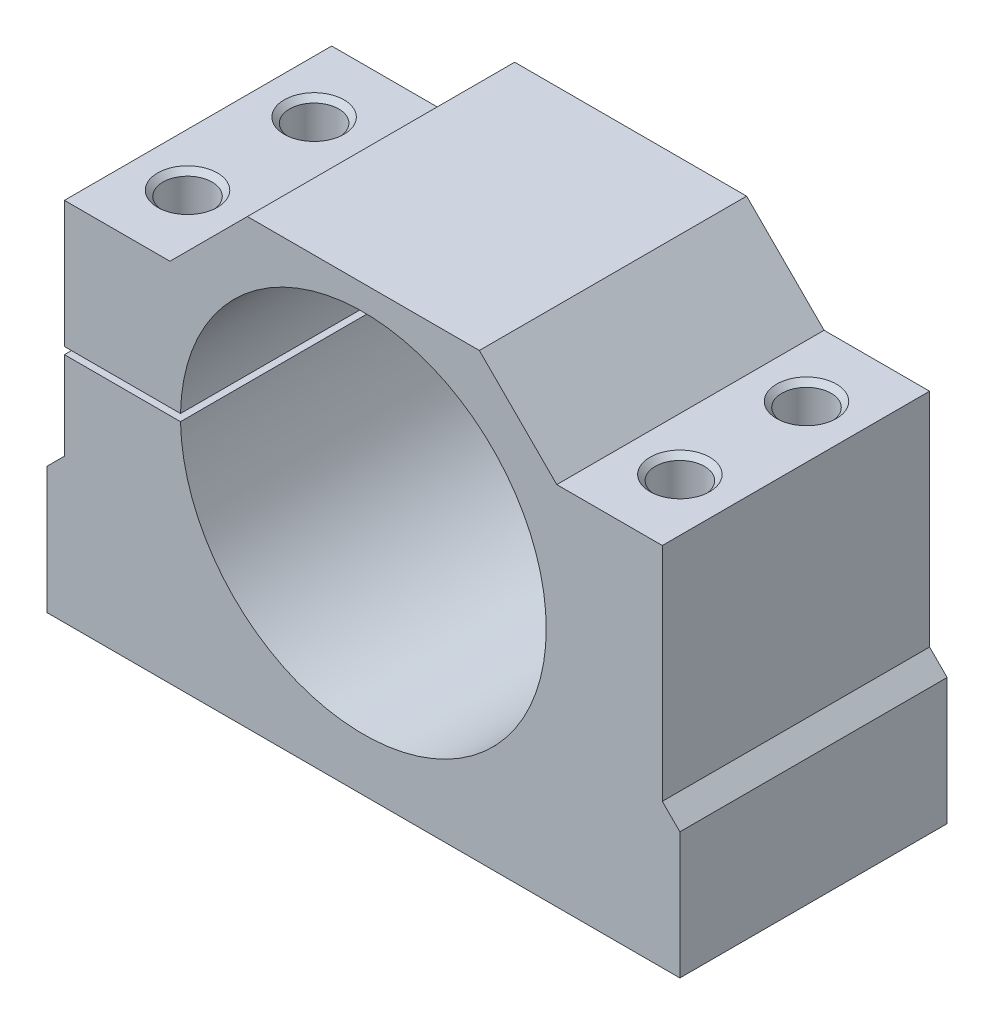
ISO-10303-21;
HEADER;
FILE_DESCRIPTION(('STEP AP214'),'2;1');
FILE_NAME('part.step','',(''),(''),'','','');
FILE_SCHEMA(('AUTOMOTIVE_DESIGN { 1 0 10303 214 1 1 1 1 }'));
ENDSEC;
DATA;
#1=APPLICATION_CONTEXT('core data for automotive mechanical design processes');
#2=APPLICATION_PROTOCOL_DEFINITION('international standard','automotive_design',2000,#1);
#3=PRODUCT_CONTEXT('',#1,'mechanical');
#4=PRODUCT('Part','Part','',(#3));
#5=PRODUCT_RELATED_PRODUCT_CATEGORY('part','',(#4));
#6=PRODUCT_DEFINITION_FORMATION('','',#4);
#7=PRODUCT_DEFINITION_CONTEXT('part definition',#1,'design');
#8=PRODUCT_DEFINITION('design','',#6,#7);
#9=PRODUCT_DEFINITION_SHAPE('','',#8);
#10=(LENGTH_UNIT() NAMED_UNIT(*) SI_UNIT(.MILLI.,.METRE.));
#11=(NAMED_UNIT(*) PLANE_ANGLE_UNIT() SI_UNIT($,.RADIAN.));
#12=(NAMED_UNIT(*) SI_UNIT($,.STERADIAN.) SOLID_ANGLE_UNIT());
#13=UNCERTAINTY_MEASURE_WITH_UNIT(LENGTH_MEASURE(1.E-05),#10,'distance_accuracy_value','');
#14=(GEOMETRIC_REPRESENTATION_CONTEXT(3) GLOBAL_UNCERTAINTY_ASSIGNED_CONTEXT((#13)) GLOBAL_UNIT_ASSIGNED_CONTEXT((#10,
#11,#12)) REPRESENTATION_CONTEXT('',''));
#15=CARTESIAN_POINT('',(0.,0.,0.));
#16=DIRECTION('',(0.,0.,1.));
#17=DIRECTION('',(1.,0.,0.));
#18=AXIS2_PLACEMENT_3D('',#15,#16,#17);
#19=CARTESIAN_POINT('',(2.5,20.5,38.));
#20=DIRECTION('',(1.,0.,0.));
#21=DIRECTION('',(0.,0.,-1.));
#22=AXIS2_PLACEMENT_3D('',#19,#20,#21);
#23=PLANE('',#22);
#24=DIRECTION('',(0.,-1.,0.));
#25=VECTOR('',#24,1.);
#26=CARTESIAN_POINT('',(2.5,20.5,0.));
#27=LINE('',#26,#25);
#28=CARTESIAN_POINT('',(2.5,52.,0.));
#29=VERTEX_POINT('',#28);
#30=CARTESIAN_POINT('',(2.5,34.,0.));
#31=VERTEX_POINT('',#30);
#32=EDGE_CURVE('E167',#29,#31,#27,.T.);
#33=ORIENTED_EDGE('',*,*,#32,.T.);
#34=DIRECTION('',(0.,0.,1.));
#35=VECTOR('',#34,1.);
#36=CARTESIAN_POINT('',(2.5,34.,0.));
#37=LINE('',#36,#35);
#38=CARTESIAN_POINT('',(2.5,34.,38.));
#39=VERTEX_POINT('',#38);
#40=EDGE_CURVE('E161',#31,#39,#37,.T.);
#41=ORIENTED_EDGE('',*,*,#40,.T.);
#42=DIRECTION('',(0.,-1.,0.));
#43=VECTOR('',#42,1.);
#44=CARTESIAN_POINT('',(2.5,20.5,38.));
#45=LINE('',#44,#43);
#46=CARTESIAN_POINT('',(2.5,52.,38.));
#47=VERTEX_POINT('',#46);
#48=EDGE_CURVE('E249',#47,#39,#45,.T.);
#49=ORIENTED_EDGE('',*,*,#48,.F.);
#50=DIRECTION('',(0.,0.,-1.));
#51=VECTOR('',#50,1.);
#52=CARTESIAN_POINT('',(2.5,52.,38.));
#53=LINE('',#52,#51);
#54=EDGE_CURVE('E188',#47,#29,#53,.T.);
#55=ORIENTED_EDGE('',*,*,#54,.T.);
#56=EDGE_LOOP('',(#33,#41,#49,#55));
#57=FACE_BOUND('',#56,.T.);
#58=ADVANCED_FACE('F33',(#57),#23,.F.);
#59=CARTESIAN_POINT('',(90.,0.,38.));
#60=DIRECTION('',(0.,1.,0.));
#61=DIRECTION('',(0.,0.,1.));
#62=AXIS2_PLACEMENT_3D('',#59,#60,#61);
#63=PLANE('',#62);
#64=CARTESIAN_POINT('',(10.,0.,10.));
#65=DIRECTION('',(0.,1.,0.));
#66=DIRECTION('',(0.,0.,1.));
#67=AXIS2_PLACEMENT_3D('',#64,#65,#66);
#68=CIRCLE('',#67,3.49999999999999);
#69=CARTESIAN_POINT('',(10.,0.,13.5));
#70=VERTEX_POINT('',#69);
#71=EDGE_CURVE('E561',#70,#70,#68,.T.);
#72=ORIENTED_EDGE('',*,*,#71,.T.);
#73=EDGE_LOOP('',(#72));
#74=FACE_BOUND('',#73,.T.);
#75=CARTESIAN_POINT('',(10.,0.,28.));
#76=DIRECTION('',(0.,1.,0.));
#77=DIRECTION('',(0.,0.,1.));
#78=AXIS2_PLACEMENT_3D('',#75,#76,#77);
#79=CIRCLE('',#78,3.49999999999999);
#80=CARTESIAN_POINT('',(10.,0.,31.5));
#81=VERTEX_POINT('',#80);
#82=EDGE_CURVE('E576',#81,#81,#79,.T.);
#83=ORIENTED_EDGE('',*,*,#82,.T.);
#84=EDGE_LOOP('',(#83));
#85=FACE_BOUND('',#84,.T.);
#86=CARTESIAN_POINT('',(80.,0.,28.));
#87=DIRECTION('',(0.,1.,0.));
#88=DIRECTION('',(0.,0.,1.));
#89=AXIS2_PLACEMENT_3D('',#86,#87,#88);
#90=CIRCLE('',#89,3.49999999999999);
#91=CARTESIAN_POINT('',(80.,0.,31.5));
#92=VERTEX_POINT('',#91);
#93=EDGE_CURVE('E591',#92,#92,#90,.T.);
#94=ORIENTED_EDGE('',*,*,#93,.T.);
#95=EDGE_LOOP('',(#94));
#96=FACE_BOUND('',#95,.T.);
#97=CARTESIAN_POINT('',(80.,0.,10.));
#98=DIRECTION('',(0.,1.,0.));
#99=DIRECTION('',(0.,0.,1.));
#100=AXIS2_PLACEMENT_3D('',#97,#98,#99);
#101=CIRCLE('',#100,3.49999999999999);
#102=CARTESIAN_POINT('',(80.,0.,13.5));
#103=VERTEX_POINT('',#102);
#104=EDGE_CURVE('E600',#103,#103,#101,.T.);
#105=ORIENTED_EDGE('',*,*,#104,.T.);
#106=EDGE_LOOP('',(#105));
#107=FACE_BOUND('',#106,.T.);
#108=DIRECTION('',(1.,0.,0.));
#109=VECTOR('',#108,1.);
#110=CARTESIAN_POINT('',(90.,0.,0.));
#111=LINE('',#110,#109);
#112=CARTESIAN_POINT('',(0.,0.,0.));
#113=VERTEX_POINT('',#112);
#114=CARTESIAN_POINT('',(90.,0.,0.));
#115=VERTEX_POINT('',#114);
#116=EDGE_CURVE('E226',#113,#115,#111,.T.);
#117=ORIENTED_EDGE('',*,*,#116,.T.);
#118=DIRECTION('',(0.,0.,-1.));
#119=VECTOR('',#118,1.);
#120=CARTESIAN_POINT('',(90.,0.,38.));
#121=LINE('',#120,#119);
#122=CARTESIAN_POINT('',(90.,0.,38.));
#123=VERTEX_POINT('',#122);
#124=EDGE_CURVE('E212',#123,#115,#121,.T.);
#125=ORIENTED_EDGE('',*,*,#124,.F.);
#126=DIRECTION('',(1.,0.,0.));
#127=VECTOR('',#126,1.);
#128=CARTESIAN_POINT('',(90.,0.,38.));
#129=LINE('',#128,#127);
#130=CARTESIAN_POINT('',(0.,0.,38.));
#131=VERTEX_POINT('',#130);
#132=EDGE_CURVE('E178',#131,#123,#129,.T.);
#133=ORIENTED_EDGE('',*,*,#132,.F.);
#134=DIRECTION('',(0.,0.,-1.));
#135=VECTOR('',#134,1.);
#136=CARTESIAN_POINT('',(0.,0.,38.));
#137=LINE('',#136,#135);
#138=EDGE_CURVE('E179',#131,#113,#137,.T.);
#139=ORIENTED_EDGE('',*,*,#138,.T.);
#140=EDGE_LOOP('',(#117,#125,#133,#139));
#141=FACE_BOUND('',#140,.T.);
#142=ADVANCED_FACE('F35',(#74,#85,#96,#107,#141),#63,.F.);
#143=CARTESIAN_POINT('',(90.,18.,38.));
#144=DIRECTION('',(-1.,0.,0.));
#145=DIRECTION('',(0.,0.,1.));
#146=AXIS2_PLACEMENT_3D('',#143,#144,#145);
#147=PLANE('',#146);
#148=DIRECTION('',(0.,1.,0.));
#149=VECTOR('',#148,1.);
#150=CARTESIAN_POINT('',(90.,18.,0.));
#151=LINE('',#150,#149);
#152=CARTESIAN_POINT('',(90.,18.,0.));
#153=VERTEX_POINT('',#152);
#154=EDGE_CURVE('E256',#115,#153,#151,.T.);
#155=ORIENTED_EDGE('',*,*,#154,.T.);
#156=DIRECTION('',(0.,0.,-1.));
#157=VECTOR('',#156,1.);
#158=CARTESIAN_POINT('',(90.,18.,38.));
#159=LINE('',#158,#157);
#160=CARTESIAN_POINT('',(90.,18.,38.));
#161=VERTEX_POINT('',#160);
#162=EDGE_CURVE('E209',#161,#153,#159,.T.);
#163=ORIENTED_EDGE('',*,*,#162,.F.);
#164=DIRECTION('',(0.,1.,0.));
#165=VECTOR('',#164,1.);
#166=CARTESIAN_POINT('',(90.,18.,38.));
#167=LINE('',#166,#165);
#168=EDGE_CURVE('E233',#123,#161,#167,.T.);
#169=ORIENTED_EDGE('',*,*,#168,.F.);
#170=ORIENTED_EDGE('',*,*,#124,.T.);
#171=EDGE_LOOP('',(#155,#163,#169,#170));
#172=FACE_BOUND('',#171,.T.);
#173=ADVANCED_FACE('F308',(#172),#147,.F.);
#174=CARTESIAN_POINT('',(87.5,20.5,38.));
#175=DIRECTION('',(-0.707106781186546,-0.707106781186549,0.));
#176=DIRECTION('',(0.707106781186549,-0.707106781186546,0.));
#177=AXIS2_PLACEMENT_3D('',#174,#175,#176);
#178=PLANE('',#177);
#179=DIRECTION('',(-0.707106781186549,0.707106781186546,0.));
#180=VECTOR('',#179,1.);
#181=CARTESIAN_POINT('',(87.5,20.5,0.));
#182=LINE('',#181,#180);
#183=CARTESIAN_POINT('',(87.5,20.5,0.));
#184=VERTEX_POINT('',#183);
#185=EDGE_CURVE('E258',#153,#184,#182,.T.);
#186=ORIENTED_EDGE('',*,*,#185,.T.);
#187=DIRECTION('',(0.,0.,-1.));
#188=VECTOR('',#187,1.);
#189=CARTESIAN_POINT('',(87.5,20.5,38.));
#190=LINE('',#189,#188);
#191=CARTESIAN_POINT('',(87.5,20.5,38.));
#192=VERTEX_POINT('',#191);
#193=EDGE_CURVE('E206',#192,#184,#190,.T.);
#194=ORIENTED_EDGE('',*,*,#193,.F.);
#195=DIRECTION('',(-0.707106781186549,0.707106781186546,0.));
#196=VECTOR('',#195,1.);
#197=CARTESIAN_POINT('',(87.5,20.5,38.));
#198=LINE('',#197,#196);
#199=EDGE_CURVE('E235',#161,#192,#198,.T.);
#200=ORIENTED_EDGE('',*,*,#199,.F.);
#201=ORIENTED_EDGE('',*,*,#162,.T.);
#202=EDGE_LOOP('',(#186,#194,#200,#201));
#203=FACE_BOUND('',#202,.T.);
#204=ADVANCED_FACE('F304',(#203),#178,.F.);
#205=CARTESIAN_POINT('',(87.5,52.,38.));
#206=DIRECTION('',(-1.,0.,0.));
#207=DIRECTION('',(0.,0.,1.));
#208=AXIS2_PLACEMENT_3D('',#205,#206,#207);
#209=PLANE('',#208);
#210=DIRECTION('',(0.,1.,0.));
#211=VECTOR('',#210,1.);
#212=CARTESIAN_POINT('',(87.5,52.,0.));
#213=LINE('',#212,#211);
#214=CARTESIAN_POINT('',(87.5,52.,0.));
#215=VERTEX_POINT('',#214);
#216=EDGE_CURVE('E260',#184,#215,#213,.T.);
#217=ORIENTED_EDGE('',*,*,#216,.T.);
#218=DIRECTION('',(0.,0.,-1.));
#219=VECTOR('',#218,1.);
#220=CARTESIAN_POINT('',(87.5,52.,38.));
#221=LINE('',#220,#219);
#222=CARTESIAN_POINT('',(87.5,52.,38.));
#223=VERTEX_POINT('',#222);
#224=EDGE_CURVE('E203',#223,#215,#221,.T.);
#225=ORIENTED_EDGE('',*,*,#224,.F.);
#226=DIRECTION('',(0.,1.,0.));
#227=VECTOR('',#226,1.);
#228=CARTESIAN_POINT('',(87.5,52.,38.));
#229=LINE('',#228,#227);
#230=EDGE_CURVE('E237',#192,#223,#229,.T.);
#231=ORIENTED_EDGE('',*,*,#230,.F.);
#232=ORIENTED_EDGE('',*,*,#193,.T.);
#233=EDGE_LOOP('',(#217,#225,#231,#232));
#234=FACE_BOUND('',#233,.T.);
#235=ADVANCED_FACE('F299',(#234),#209,.F.);
#236=CARTESIAN_POINT('',(72.5,52.,38.));
#237=DIRECTION('',(0.,-1.,0.));
#238=DIRECTION('',(1.,0.,0.));
#239=AXIS2_PLACEMENT_3D('',#236,#237,#238);
#240=PLANE('',#239);
#241=CARTESIAN_POINT('',(80.,52.,28.));
#242=DIRECTION('',(0.,1.,0.));
#243=DIRECTION('',(0.,0.,1.));
#244=AXIS2_PLACEMENT_3D('',#241,#242,#243);
#245=CIRCLE('',#244,4.25);
#246=CARTESIAN_POINT('',(80.,52.,32.25));
#247=VERTEX_POINT('',#246);
#248=EDGE_CURVE('E585',#247,#247,#245,.T.);
#249=ORIENTED_EDGE('',*,*,#248,.F.);
#250=EDGE_LOOP('',(#249));
#251=FACE_BOUND('',#250,.T.);
#252=CARTESIAN_POINT('',(80.,52.,10.));
#253=DIRECTION('',(0.,1.,0.));
#254=DIRECTION('',(0.,0.,1.));
#255=AXIS2_PLACEMENT_3D('',#252,#253,#254);
#256=CIRCLE('',#255,4.25);
#257=CARTESIAN_POINT('',(80.,52.,14.25));
#258=VERTEX_POINT('',#257);
#259=EDGE_CURVE('E594',#258,#258,#256,.T.);
#260=ORIENTED_EDGE('',*,*,#259,.F.);
#261=EDGE_LOOP('',(#260));
#262=FACE_BOUND('',#261,.T.);
#263=DIRECTION('',(-1.,0.,0.));
#264=VECTOR('',#263,1.);
#265=CARTESIAN_POINT('',(72.5,52.,0.));
#266=LINE('',#265,#264);
#267=CARTESIAN_POINT('',(72.5,52.,0.));
#268=VERTEX_POINT('',#267);
#269=EDGE_CURVE('E262',#215,#268,#266,.T.);
#270=ORIENTED_EDGE('',*,*,#269,.T.);
#271=DIRECTION('',(0.,0.,-1.));
#272=VECTOR('',#271,1.);
#273=CARTESIAN_POINT('',(72.5,52.,38.));
#274=LINE('',#273,#272);
#275=CARTESIAN_POINT('',(72.5,52.,38.));
#276=VERTEX_POINT('',#275);
#277=EDGE_CURVE('E200',#276,#268,#274,.T.);
#278=ORIENTED_EDGE('',*,*,#277,.F.);
#279=DIRECTION('',(-1.,0.,0.));
#280=VECTOR('',#279,1.);
#281=CARTESIAN_POINT('',(72.5,52.,38.));
#282=LINE('',#281,#280);
#283=EDGE_CURVE('E239',#223,#276,#282,.T.);
#284=ORIENTED_EDGE('',*,*,#283,.F.);
#285=ORIENTED_EDGE('',*,*,#224,.T.);
#286=EDGE_LOOP('',(#270,#278,#284,#285));
#287=FACE_BOUND('',#286,.T.);
#288=ADVANCED_FACE('F295',(#251,#262,#287),#240,.F.);
#289=CARTESIAN_POINT('',(61.49,63.01,38.));
#290=DIRECTION('',(-0.707106781186547,-0.707106781186549,0.));
#291=DIRECTION('',(0.707106781186549,-0.707106781186547,0.));
#292=AXIS2_PLACEMENT_3D('',#289,#290,#291);
#293=PLANE('',#292);
#294=DIRECTION('',(-0.707106781186548,0.707106781186547,0.));
#295=VECTOR('',#294,1.);
#296=CARTESIAN_POINT('',(61.49,63.01,0.));
#297=LINE('',#296,#295);
#298=CARTESIAN_POINT('',(61.49,63.01,0.));
#299=VERTEX_POINT('',#298);
#300=EDGE_CURVE('E264',#268,#299,#297,.T.);
#301=ORIENTED_EDGE('',*,*,#300,.T.);
#302=DIRECTION('',(0.,0.,-1.));
#303=VECTOR('',#302,1.);
#304=CARTESIAN_POINT('',(61.49,63.01,38.));
#305=LINE('',#304,#303);
#306=CARTESIAN_POINT('',(61.49,63.01,38.));
#307=VERTEX_POINT('',#306);
#308=EDGE_CURVE('E197',#307,#299,#305,.T.);
#309=ORIENTED_EDGE('',*,*,#308,.F.);
#310=DIRECTION('',(-0.707106781186548,0.707106781186547,0.));
#311=VECTOR('',#310,1.);
#312=CARTESIAN_POINT('',(61.49,63.01,38.));
#313=LINE('',#312,#311);
#314=EDGE_CURVE('E241',#276,#307,#313,.T.);
#315=ORIENTED_EDGE('',*,*,#314,.F.);
#316=ORIENTED_EDGE('',*,*,#277,.T.);
#317=EDGE_LOOP('',(#301,#309,#315,#316));
#318=FACE_BOUND('',#317,.T.);
#319=ADVANCED_FACE('F291',(#318),#293,.F.);
#320=CARTESIAN_POINT('',(28.5099999999999,63.01,38.));
#321=DIRECTION('',(0.,-1.,0.));
#322=DIRECTION('',(0.,0.,-1.));
#323=AXIS2_PLACEMENT_3D('',#320,#321,#322);
#324=PLANE('',#323);
#325=DIRECTION('',(-1.,0.,0.));
#326=VECTOR('',#325,1.);
#327=CARTESIAN_POINT('',(28.5099999999999,63.01,0.));
#328=LINE('',#327,#326);
#329=CARTESIAN_POINT('',(28.5099999999999,63.01,0.));
#330=VERTEX_POINT('',#329);
#331=EDGE_CURVE('E266',#299,#330,#328,.T.);
#332=ORIENTED_EDGE('',*,*,#331,.T.);
#333=DIRECTION('',(0.,0.,-1.));
#334=VECTOR('',#333,1.);
#335=CARTESIAN_POINT('',(28.5099999999999,63.01,38.));
#336=LINE('',#335,#334);
#337=CARTESIAN_POINT('',(28.5099999999999,63.01,38.));
#338=VERTEX_POINT('',#337);
#339=EDGE_CURVE('E194',#338,#330,#336,.T.);
#340=ORIENTED_EDGE('',*,*,#339,.F.);
#341=DIRECTION('',(-1.,0.,0.));
#342=VECTOR('',#341,1.);
#343=CARTESIAN_POINT('',(28.5099999999999,63.01,38.));
#344=LINE('',#343,#342);
#345=EDGE_CURVE('E243',#307,#338,#344,.T.);
#346=ORIENTED_EDGE('',*,*,#345,.F.);
#347=ORIENTED_EDGE('',*,*,#308,.T.);
#348=EDGE_LOOP('',(#332,#340,#346,#347));
#349=FACE_BOUND('',#348,.T.);
#350=ADVANCED_FACE('F286',(#349),#324,.F.);
#351=CARTESIAN_POINT('',(17.5,52.,38.));
#352=DIRECTION('',(0.707106781186549,-0.707106781186546,0.));
#353=DIRECTION('',(0.707106781186546,0.707106781186549,0.));
#354=AXIS2_PLACEMENT_3D('',#351,#352,#353);
#355=PLANE('',#354);
#356=DIRECTION('',(-0.707106781186546,-0.707106781186549,0.));
#357=VECTOR('',#356,1.);
#358=CARTESIAN_POINT('',(17.5,52.,0.));
#359=LINE('',#358,#357);
#360=CARTESIAN_POINT('',(17.5,52.,0.));
#361=VERTEX_POINT('',#360);
#362=EDGE_CURVE('E171',#330,#361,#359,.T.);
#363=ORIENTED_EDGE('',*,*,#362,.T.);
#364=DIRECTION('',(0.,0.,-1.));
#365=VECTOR('',#364,1.);
#366=CARTESIAN_POINT('',(17.5,52.,38.));
#367=LINE('',#366,#365);
#368=CARTESIAN_POINT('',(17.5,52.,38.));
#369=VERTEX_POINT('',#368);
#370=EDGE_CURVE('E191',#369,#361,#367,.T.);
#371=ORIENTED_EDGE('',*,*,#370,.F.);
#372=DIRECTION('',(-0.707106781186546,-0.707106781186549,0.));
#373=VECTOR('',#372,1.);
#374=CARTESIAN_POINT('',(17.5,52.,38.));
#375=LINE('',#374,#373);
#376=EDGE_CURVE('E245',#338,#369,#375,.T.);
#377=ORIENTED_EDGE('',*,*,#376,.F.);
#378=ORIENTED_EDGE('',*,*,#339,.T.);
#379=EDGE_LOOP('',(#363,#371,#377,#378));
#380=FACE_BOUND('',#379,.T.);
#381=ADVANCED_FACE('F270',(#380),#355,.F.);
#382=CARTESIAN_POINT('',(2.5,52.,38.));
#383=DIRECTION('',(0.,-1.,0.));
#384=DIRECTION('',(1.,0.,0.));
#385=AXIS2_PLACEMENT_3D('',#382,#383,#384);
#386=PLANE('',#385);
#387=CARTESIAN_POINT('',(10.,52.,10.));
#388=DIRECTION('',(0.,1.,0.));
#389=DIRECTION('',(0.,0.,1.));
#390=AXIS2_PLACEMENT_3D('',#387,#388,#389);
#391=CIRCLE('',#390,4.25);
#392=CARTESIAN_POINT('',(10.,52.,14.25));
#393=VERTEX_POINT('',#392);
#394=EDGE_CURVE('E633',#393,#393,#391,.T.);
#395=ORIENTED_EDGE('',*,*,#394,.F.);
#396=EDGE_LOOP('',(#395));
#397=FACE_BOUND('',#396,.T.);
#398=CARTESIAN_POINT('',(10.,52.,28.));
#399=DIRECTION('',(0.,1.,0.));
#400=DIRECTION('',(0.,0.,1.));
#401=AXIS2_PLACEMENT_3D('',#398,#399,#400);
#402=CIRCLE('',#401,4.25);
#403=CARTESIAN_POINT('',(10.,52.,32.25));
#404=VERTEX_POINT('',#403);
#405=EDGE_CURVE('E565',#404,#404,#402,.T.);
#406=ORIENTED_EDGE('',*,*,#405,.F.);
#407=EDGE_LOOP('',(#406));
#408=FACE_BOUND('',#407,.T.);
#409=DIRECTION('',(-1.,0.,0.));
#410=VECTOR('',#409,1.);
#411=CARTESIAN_POINT('',(2.5,52.,0.));
#412=LINE('',#411,#410);
#413=EDGE_CURVE('E168',#361,#29,#412,.T.);
#414=ORIENTED_EDGE('',*,*,#413,.T.);
#415=ORIENTED_EDGE('',*,*,#54,.F.);
#416=DIRECTION('',(-1.,0.,0.));
#417=VECTOR('',#416,1.);
#418=CARTESIAN_POINT('',(2.5,52.,38.));
#419=LINE('',#418,#417);
#420=EDGE_CURVE('E247',#369,#47,#419,.T.);
#421=ORIENTED_EDGE('',*,*,#420,.F.);
#422=ORIENTED_EDGE('',*,*,#370,.T.);
#423=EDGE_LOOP('',(#414,#415,#421,#422));
#424=FACE_BOUND('',#423,.T.);
#425=ADVANCED_FACE('F277',(#397,#408,#424),#386,.F.);
#426=CARTESIAN_POINT('',(2.5,33.,38.));
#427=VERTEX_POINT('',#426);
#428=CARTESIAN_POINT('',(2.5,20.5,38.));
#429=VERTEX_POINT('',#428);
#430=EDGE_CURVE('E160',#427,#429,#45,.T.);
#431=ORIENTED_EDGE('',*,*,#430,.F.);
#432=DIRECTION('',(0.,0.,1.));
#433=VECTOR('',#432,1.);
#434=CARTESIAN_POINT('',(2.5,33.,0.));
#435=LINE('',#434,#433);
#436=CARTESIAN_POINT('',(2.5,33.,0.));
#437=VERTEX_POINT('',#436);
#438=EDGE_CURVE('E147',#437,#427,#435,.T.);
#439=ORIENTED_EDGE('',*,*,#438,.F.);
#440=CARTESIAN_POINT('',(2.5,20.5,0.));
#441=VERTEX_POINT('',#440);
#442=EDGE_CURVE('E158',#437,#441,#27,.T.);
#443=ORIENTED_EDGE('',*,*,#442,.T.);
#444=DIRECTION('',(0.,0.,-1.));
#445=VECTOR('',#444,1.);
#446=CARTESIAN_POINT('',(2.5,20.5,38.));
#447=LINE('',#446,#445);
#448=EDGE_CURVE('E186',#429,#441,#447,.T.);
#449=ORIENTED_EDGE('',*,*,#448,.F.);
#450=EDGE_LOOP('',(#431,#439,#443,#449));
#451=FACE_BOUND('',#450,.T.);
#452=ADVANCED_FACE('F156',(#451),#23,.F.);
#453=CARTESIAN_POINT('',(0.,18.,38.));
#454=DIRECTION('',(0.707106781186549,-0.707106781186546,0.));
#455=DIRECTION('',(0.707106781186546,0.707106781186549,0.));
#456=AXIS2_PLACEMENT_3D('',#453,#454,#455);
#457=PLANE('',#456);
#458=DIRECTION('',(-0.707106781186546,-0.707106781186549,0.));
#459=VECTOR('',#458,1.);
#460=CARTESIAN_POINT('',(0.,18.,0.));
#461=LINE('',#460,#459);
#462=CARTESIAN_POINT('',(0.,18.,0.));
#463=VERTEX_POINT('',#462);
#464=EDGE_CURVE('E166',#441,#463,#461,.T.);
#465=ORIENTED_EDGE('',*,*,#464,.T.);
#466=DIRECTION('',(0.,0.,-1.));
#467=VECTOR('',#466,1.);
#468=CARTESIAN_POINT('',(0.,18.,38.));
#469=LINE('',#468,#467);
#470=CARTESIAN_POINT('',(0.,18.,38.));
#471=VERTEX_POINT('',#470);
#472=EDGE_CURVE('E182',#471,#463,#469,.T.);
#473=ORIENTED_EDGE('',*,*,#472,.F.);
#474=DIRECTION('',(-0.707106781186546,-0.707106781186549,0.));
#475=VECTOR('',#474,1.);
#476=CARTESIAN_POINT('',(0.,18.,38.));
#477=LINE('',#476,#475);
#478=EDGE_CURVE('E251',#429,#471,#477,.T.);
#479=ORIENTED_EDGE('',*,*,#478,.F.);
#480=ORIENTED_EDGE('',*,*,#448,.T.);
#481=EDGE_LOOP('',(#465,#473,#479,#480));
#482=FACE_BOUND('',#481,.T.);
#483=ADVANCED_FACE('F319',(#482),#457,.F.);
#484=CARTESIAN_POINT('',(0.,0.,38.));
#485=DIRECTION('',(1.,0.,0.));
#486=DIRECTION('',(0.,0.,-1.));
#487=AXIS2_PLACEMENT_3D('',#484,#485,#486);
#488=PLANE('',#487);
#489=DIRECTION('',(0.,-1.,0.));
#490=VECTOR('',#489,1.);
#491=CARTESIAN_POINT('',(0.,0.,0.));
#492=LINE('',#491,#490);
#493=EDGE_CURVE('E176',#463,#113,#492,.T.);
#494=ORIENTED_EDGE('',*,*,#493,.T.);
#495=ORIENTED_EDGE('',*,*,#138,.F.);
#496=DIRECTION('',(0.,-1.,0.));
#497=VECTOR('',#496,1.);
#498=CARTESIAN_POINT('',(0.,0.,38.));
#499=LINE('',#498,#497);
#500=EDGE_CURVE('E183',#471,#131,#499,.T.);
#501=ORIENTED_EDGE('',*,*,#500,.F.);
#502=ORIENTED_EDGE('',*,*,#472,.T.);
#503=EDGE_LOOP('',(#494,#495,#501,#502));
#504=FACE_BOUND('',#503,.T.);
#505=ADVANCED_FACE('F314',(#504),#488,.F.);
#506=CARTESIAN_POINT('',(0.,0.,38.));
#507=DIRECTION('',(0.,0.,-1.));
#508=DIRECTION('',(-1.,0.,0.));
#509=AXIS2_PLACEMENT_3D('',#506,#507,#508);
#510=PLANE('',#509);
#511=ORIENTED_EDGE('',*,*,#48,.T.);
#512=DIRECTION('',(-1.,0.,0.));
#513=VECTOR('',#512,1.);
#514=CARTESIAN_POINT('',(2.5,34.,38.));
#515=LINE('',#514,#513);
#516=CARTESIAN_POINT('',(19.0048081368881,34.,38.));
#517=VERTEX_POINT('',#516);
#518=EDGE_CURVE('E152',#517,#39,#515,.T.);
#519=ORIENTED_EDGE('',*,*,#518,.F.);
#520=CARTESIAN_POINT('',(45.,33.5,38.));
#521=DIRECTION('',(0.,0.,1.));
#522=DIRECTION('',(1.,0.,0.));
#523=AXIS2_PLACEMENT_3D('',#520,#521,#522);
#524=CIRCLE('',#523,26.);
#525=CARTESIAN_POINT('',(19.0048081368881,33.,38.));
#526=VERTEX_POINT('',#525);
#527=EDGE_CURVE('E219',#526,#517,#524,.T.);
#528=ORIENTED_EDGE('',*,*,#527,.F.);
#529=DIRECTION('',(1.,0.,0.));
#530=VECTOR('',#529,1.);
#531=CARTESIAN_POINT('',(19.5,33.,38.));
#532=LINE('',#531,#530);
#533=EDGE_CURVE('E49',#427,#526,#532,.T.);
#534=ORIENTED_EDGE('',*,*,#533,.F.);
#535=ORIENTED_EDGE('',*,*,#430,.T.);
#536=ORIENTED_EDGE('',*,*,#478,.T.);
#537=ORIENTED_EDGE('',*,*,#500,.T.);
#538=ORIENTED_EDGE('',*,*,#132,.T.);
#539=ORIENTED_EDGE('',*,*,#168,.T.);
#540=ORIENTED_EDGE('',*,*,#199,.T.);
#541=ORIENTED_EDGE('',*,*,#230,.T.);
#542=ORIENTED_EDGE('',*,*,#283,.T.);
#543=ORIENTED_EDGE('',*,*,#314,.T.);
#544=ORIENTED_EDGE('',*,*,#345,.T.);
#545=ORIENTED_EDGE('',*,*,#376,.T.);
#546=ORIENTED_EDGE('',*,*,#420,.T.);
#547=EDGE_LOOP('',(#511,#519,#528,#534,#535,#536,#537,#538,#539,#540,#541,#542,#543,#544,#545,#546));
#548=FACE_BOUND('',#547,.T.);
#549=ADVANCED_FACE('F224',(#548),#510,.F.);
#550=CARTESIAN_POINT('',(0.,0.,0.));
#551=DIRECTION('',(0.,0.,-1.));
#552=DIRECTION('',(-1.,0.,0.));
#553=AXIS2_PLACEMENT_3D('',#550,#551,#552);
#554=PLANE('',#553);
#555=DIRECTION('',(-1.,0.,0.));
#556=VECTOR('',#555,1.);
#557=CARTESIAN_POINT('',(2.5,34.,0.));
#558=LINE('',#557,#556);
#559=CARTESIAN_POINT('',(19.0048081368881,34.,0.));
#560=VERTEX_POINT('',#559);
#561=EDGE_CURVE('E57',#560,#31,#558,.T.);
#562=ORIENTED_EDGE('',*,*,#561,.T.);
#563=ORIENTED_EDGE('',*,*,#32,.F.);
#564=ORIENTED_EDGE('',*,*,#413,.F.);
#565=ORIENTED_EDGE('',*,*,#362,.F.);
#566=ORIENTED_EDGE('',*,*,#331,.F.);
#567=ORIENTED_EDGE('',*,*,#300,.F.);
#568=ORIENTED_EDGE('',*,*,#269,.F.);
#569=ORIENTED_EDGE('',*,*,#216,.F.);
#570=ORIENTED_EDGE('',*,*,#185,.F.);
#571=ORIENTED_EDGE('',*,*,#154,.F.);
#572=ORIENTED_EDGE('',*,*,#116,.F.);
#573=ORIENTED_EDGE('',*,*,#493,.F.);
#574=ORIENTED_EDGE('',*,*,#464,.F.);
#575=ORIENTED_EDGE('',*,*,#442,.F.);
#576=DIRECTION('',(1.,0.,0.));
#577=VECTOR('',#576,1.);
#578=CARTESIAN_POINT('',(19.5,33.,0.));
#579=LINE('',#578,#577);
#580=CARTESIAN_POINT('',(19.0048081368881,33.,0.));
#581=VERTEX_POINT('',#580);
#582=EDGE_CURVE('E144',#437,#581,#579,.T.);
#583=ORIENTED_EDGE('',*,*,#582,.T.);
#584=CARTESIAN_POINT('',(45.,33.5,0.));
#585=DIRECTION('',(0.,0.,1.));
#586=DIRECTION('',(1.,0.,0.));
#587=AXIS2_PLACEMENT_3D('',#584,#585,#586);
#588=CIRCLE('',#587,26.);
#589=EDGE_CURVE('E220',#581,#560,#588,.T.);
#590=ORIENTED_EDGE('',*,*,#589,.T.);
#591=EDGE_LOOP('',(#562,#563,#564,#565,#566,#567,#568,#569,#570,#571,#572,#573,#574,#575,#583,#590));
#592=FACE_BOUND('',#591,.T.);
#593=ADVANCED_FACE('F164',(#592),#554,.T.);
#594=CARTESIAN_POINT('',(45.,33.5,0.));
#595=DIRECTION('',(0.,0.,1.));
#596=DIRECTION('',(1.,0.,0.));
#597=AXIS2_PLACEMENT_3D('',#594,#595,#596);
#598=CYLINDRICAL_SURFACE('',#597,26.);
#599=ORIENTED_EDGE('',*,*,#527,.T.);
#600=DIRECTION('',(0.,0.,1.));
#601=VECTOR('',#600,1.);
#602=CARTESIAN_POINT('',(19.0048081368881,34.,0.));
#603=LINE('',#602,#601);
#604=EDGE_CURVE('E11',#517,#560,#603,.F.);
#605=ORIENTED_EDGE('',*,*,#604,.T.);
#606=ORIENTED_EDGE('',*,*,#589,.F.);
#607=DIRECTION('',(0.,0.,1.));
#608=VECTOR('',#607,1.);
#609=CARTESIAN_POINT('',(19.0048081368881,33.,0.));
#610=LINE('',#609,#608);
#611=EDGE_CURVE('E42',#581,#526,#610,.T.);
#612=ORIENTED_EDGE('',*,*,#611,.T.);
#613=EDGE_LOOP('',(#599,#605,#606,#612));
#614=FACE_BOUND('',#613,.T.);
#615=ADVANCED_FACE('F218',(#614),#598,.F.);
#616=CARTESIAN_POINT('',(19.5,33.,0.));
#617=DIRECTION('',(0.,-1.,0.));
#618=DIRECTION('',(0.,0.,-1.));
#619=AXIS2_PLACEMENT_3D('',#616,#617,#618);
#620=PLANE('',#619);
#621=CARTESIAN_POINT('',(10.,33.,10.));
#622=DIRECTION('',(0.,-1.,0.));
#623=DIRECTION('',(0.,0.,-1.));
#624=AXIS2_PLACEMENT_3D('',#621,#622,#623);
#625=CIRCLE('',#624,3.5);
#626=CARTESIAN_POINT('',(10.,33.,6.5));
#627=VERTEX_POINT('',#626);
#628=EDGE_CURVE('E564',#627,#627,#625,.T.);
#629=ORIENTED_EDGE('',*,*,#628,.T.);
#630=EDGE_LOOP('',(#629));
#631=FACE_BOUND('',#630,.T.);
#632=CARTESIAN_POINT('',(10.,33.,28.));
#633=DIRECTION('',(0.,-1.,0.));
#634=DIRECTION('',(0.,0.,-1.));
#635=AXIS2_PLACEMENT_3D('',#632,#633,#634);
#636=CIRCLE('',#635,3.5);
#637=CARTESIAN_POINT('',(10.,33.,24.5));
#638=VERTEX_POINT('',#637);
#639=EDGE_CURVE('E582',#638,#638,#636,.T.);
#640=ORIENTED_EDGE('',*,*,#639,.T.);
#641=EDGE_LOOP('',(#640));
#642=FACE_BOUND('',#641,.T.);
#643=ORIENTED_EDGE('',*,*,#582,.F.);
#644=ORIENTED_EDGE('',*,*,#438,.T.);
#645=ORIENTED_EDGE('',*,*,#533,.T.);
#646=ORIENTED_EDGE('',*,*,#611,.F.);
#647=EDGE_LOOP('',(#643,#644,#645,#646));
#648=FACE_BOUND('',#647,.T.);
#649=ADVANCED_FACE('F146',(#631,#642,#648),#620,.F.);
#650=CARTESIAN_POINT('',(2.5,34.,0.));
#651=DIRECTION('',(0.,1.,0.));
#652=DIRECTION('',(0.,0.,1.));
#653=AXIS2_PLACEMENT_3D('',#650,#651,#652);
#654=PLANE('',#653);
#655=CARTESIAN_POINT('',(10.,34.,10.));
#656=DIRECTION('',(0.,1.,0.));
#657=DIRECTION('',(0.,0.,1.));
#658=AXIS2_PLACEMENT_3D('',#655,#656,#657);
#659=CIRCLE('',#658,3.5);
#660=CARTESIAN_POINT('',(10.,34.,13.5));
#661=VERTEX_POINT('',#660);
#662=EDGE_CURVE('E37',#661,#661,#659,.T.);
#663=ORIENTED_EDGE('',*,*,#662,.T.);
#664=EDGE_LOOP('',(#663));
#665=FACE_BOUND('',#664,.T.);
#666=CARTESIAN_POINT('',(10.,34.,28.));
#667=DIRECTION('',(0.,1.,0.));
#668=DIRECTION('',(0.,0.,1.));
#669=AXIS2_PLACEMENT_3D('',#666,#667,#668);
#670=CIRCLE('',#669,3.5);
#671=CARTESIAN_POINT('',(10.,34.,31.5));
#672=VERTEX_POINT('',#671);
#673=EDGE_CURVE('E579',#672,#672,#670,.T.);
#674=ORIENTED_EDGE('',*,*,#673,.T.);
#675=EDGE_LOOP('',(#674));
#676=FACE_BOUND('',#675,.T.);
#677=ORIENTED_EDGE('',*,*,#518,.T.);
#678=ORIENTED_EDGE('',*,*,#40,.F.);
#679=ORIENTED_EDGE('',*,*,#561,.F.);
#680=ORIENTED_EDGE('',*,*,#604,.F.);
#681=EDGE_LOOP('',(#677,#678,#679,#680));
#682=FACE_BOUND('',#681,.T.);
#683=ADVANCED_FACE('F443',(#665,#676,#682),#654,.F.);
#684=CARTESIAN_POINT('',(80.,52.,10.));
#685=DIRECTION('',(0.,1.,0.));
#686=DIRECTION('',(0.,0.,1.));
#687=AXIS2_PLACEMENT_3D('',#684,#685,#686);
#688=CYLINDRICAL_SURFACE('',#687,3.5);
#689=ORIENTED_EDGE('',*,*,#104,.F.);
#690=EDGE_LOOP('',(#689));
#691=FACE_BOUND('',#690,.T.);
#692=CARTESIAN_POINT('',(80.,51.25,10.));
#693=DIRECTION('',(0.,1.,0.));
#694=DIRECTION('',(0.,0.,1.));
#695=AXIS2_PLACEMENT_3D('',#692,#693,#694);
#696=CIRCLE('',#695,3.5);
#697=CARTESIAN_POINT('',(80.,51.25,13.5));
#698=VERTEX_POINT('',#697);
#699=EDGE_CURVE('E597',#698,#698,#696,.T.);
#700=ORIENTED_EDGE('',*,*,#699,.T.);
#701=EDGE_LOOP('',(#700));
#702=FACE_BOUND('',#701,.T.);
#703=ADVANCED_FACE('F451',(#691,#702),#688,.F.);
#704=CARTESIAN_POINT('',(80.,52.,10.));
#705=DIRECTION('',(0.,1.,0.));
#706=DIRECTION('',(0.,0.,1.));
#707=AXIS2_PLACEMENT_3D('',#704,#705,#706);
#708=CONICAL_SURFACE('',#707,4.25,0.785398163397448);
#709=ORIENTED_EDGE('',*,*,#699,.F.);
#710=EDGE_LOOP('',(#709));
#711=FACE_BOUND('',#710,.T.);
#712=ORIENTED_EDGE('',*,*,#259,.T.);
#713=EDGE_LOOP('',(#712));
#714=FACE_BOUND('',#713,.T.);
#715=ADVANCED_FACE('F459',(#711,#714),#708,.F.);
#716=CARTESIAN_POINT('',(80.,52.,28.));
#717=DIRECTION('',(0.,1.,0.));
#718=DIRECTION('',(0.,0.,1.));
#719=AXIS2_PLACEMENT_3D('',#716,#717,#718);
#720=CYLINDRICAL_SURFACE('',#719,3.5);
#721=ORIENTED_EDGE('',*,*,#93,.F.);
#722=EDGE_LOOP('',(#721));
#723=FACE_BOUND('',#722,.T.);
#724=CARTESIAN_POINT('',(80.,51.25,28.));
#725=DIRECTION('',(0.,1.,0.));
#726=DIRECTION('',(0.,0.,1.));
#727=AXIS2_PLACEMENT_3D('',#724,#725,#726);
#728=CIRCLE('',#727,3.5);
#729=CARTESIAN_POINT('',(80.,51.25,31.5));
#730=VERTEX_POINT('',#729);
#731=EDGE_CURVE('E588',#730,#730,#728,.T.);
#732=ORIENTED_EDGE('',*,*,#731,.T.);
#733=EDGE_LOOP('',(#732));
#734=FACE_BOUND('',#733,.T.);
#735=ADVANCED_FACE('F467',(#723,#734),#720,.F.);
#736=CARTESIAN_POINT('',(80.,52.,28.));
#737=DIRECTION('',(0.,1.,0.));
#738=DIRECTION('',(0.,0.,1.));
#739=AXIS2_PLACEMENT_3D('',#736,#737,#738);
#740=CONICAL_SURFACE('',#739,4.25,0.785398163397448);
#741=ORIENTED_EDGE('',*,*,#731,.F.);
#742=EDGE_LOOP('',(#741));
#743=FACE_BOUND('',#742,.T.);
#744=ORIENTED_EDGE('',*,*,#248,.T.);
#745=EDGE_LOOP('',(#744));
#746=FACE_BOUND('',#745,.T.);
#747=ADVANCED_FACE('F475',(#743,#746),#740,.F.);
#748=CARTESIAN_POINT('',(10.,52.,28.));
#749=DIRECTION('',(0.,1.,0.));
#750=DIRECTION('',(0.,0.,1.));
#751=AXIS2_PLACEMENT_3D('',#748,#749,#750);
#752=CYLINDRICAL_SURFACE('',#751,3.5);
#753=ORIENTED_EDGE('',*,*,#82,.F.);
#754=EDGE_LOOP('',(#753));
#755=FACE_BOUND('',#754,.T.);
#756=ORIENTED_EDGE('',*,*,#639,.F.);
#757=EDGE_LOOP('',(#756));
#758=FACE_BOUND('',#757,.T.);
#759=ADVANCED_FACE('F483',(#755,#758),#752,.F.);
#760=CARTESIAN_POINT('',(10.,51.25,28.));
#761=DIRECTION('',(0.,1.,0.));
#762=DIRECTION('',(0.,0.,1.));
#763=AXIS2_PLACEMENT_3D('',#760,#761,#762);
#764=CIRCLE('',#763,3.5);
#765=CARTESIAN_POINT('',(10.,51.25,31.5));
#766=VERTEX_POINT('',#765);
#767=EDGE_CURVE('E568',#766,#766,#764,.T.);
#768=ORIENTED_EDGE('',*,*,#767,.T.);
#769=EDGE_LOOP('',(#768));
#770=FACE_BOUND('',#769,.T.);
#771=ORIENTED_EDGE('',*,*,#673,.F.);
#772=EDGE_LOOP('',(#771));
#773=FACE_BOUND('',#772,.T.);
#774=ADVANCED_FACE('F491',(#770,#773),#752,.F.);
#775=CARTESIAN_POINT('',(10.,52.,28.));
#776=DIRECTION('',(0.,1.,0.));
#777=DIRECTION('',(0.,0.,1.));
#778=AXIS2_PLACEMENT_3D('',#775,#776,#777);
#779=CONICAL_SURFACE('',#778,4.25,0.785398163397448);
#780=ORIENTED_EDGE('',*,*,#767,.F.);
#781=EDGE_LOOP('',(#780));
#782=FACE_BOUND('',#781,.T.);
#783=ORIENTED_EDGE('',*,*,#405,.T.);
#784=EDGE_LOOP('',(#783));
#785=FACE_BOUND('',#784,.T.);
#786=ADVANCED_FACE('F499',(#782,#785),#779,.F.);
#787=CARTESIAN_POINT('',(10.,52.,10.));
#788=DIRECTION('',(0.,1.,0.));
#789=DIRECTION('',(0.,0.,1.));
#790=AXIS2_PLACEMENT_3D('',#787,#788,#789);
#791=CYLINDRICAL_SURFACE('',#790,3.5);
#792=CARTESIAN_POINT('',(10.,51.25,10.));
#793=DIRECTION('',(0.,1.,0.));
#794=DIRECTION('',(0.,0.,1.));
#795=AXIS2_PLACEMENT_3D('',#792,#793,#794);
#796=CIRCLE('',#795,3.5);
#797=CARTESIAN_POINT('',(10.,51.25,13.5));
#798=VERTEX_POINT('',#797);
#799=EDGE_CURVE('E630',#798,#798,#796,.T.);
#800=ORIENTED_EDGE('',*,*,#799,.T.);
#801=EDGE_LOOP('',(#800));
#802=FACE_BOUND('',#801,.T.);
#803=ORIENTED_EDGE('',*,*,#662,.F.);
#804=EDGE_LOOP('',(#803));
#805=FACE_BOUND('',#804,.T.);
#806=ADVANCED_FACE('F506',(#802,#805),#791,.F.);
#807=CARTESIAN_POINT('',(10.,52.,10.));
#808=DIRECTION('',(0.,1.,0.));
#809=DIRECTION('',(0.,0.,1.));
#810=AXIS2_PLACEMENT_3D('',#807,#808,#809);
#811=CONICAL_SURFACE('',#810,4.25,0.785398163397448);
#812=ORIENTED_EDGE('',*,*,#799,.F.);
#813=EDGE_LOOP('',(#812));
#814=FACE_BOUND('',#813,.T.);
#815=ORIENTED_EDGE('',*,*,#394,.T.);
#816=EDGE_LOOP('',(#815));
#817=FACE_BOUND('',#816,.T.);
#818=ADVANCED_FACE('F514',(#814,#817),#811,.F.);
#819=ORIENTED_EDGE('',*,*,#71,.F.);
#820=EDGE_LOOP('',(#819));
#821=FACE_BOUND('',#820,.T.);
#822=ORIENTED_EDGE('',*,*,#628,.F.);
#823=EDGE_LOOP('',(#822));
#824=FACE_BOUND('',#823,.T.);
#825=ADVANCED_FACE('F517',(#821,#824),#791,.F.);
#826=CLOSED_SHELL('',(#58,#142,#173,#204,#235,#288,#319,#350,#381,#425,#452,#483,#505,#549,#593,
#615,#649,#683,#703,#715,#735,#747,#759,#774,#786,#806,#818,#825));
#827=MANIFOLD_SOLID_BREP('B2',#826);
#828=ADVANCED_BREP_SHAPE_REPRESENTATION('',(#18,#827),#14);
#829=SHAPE_DEFINITION_REPRESENTATION(#9,#828);
ENDSEC;
END-ISO-10303-21;
